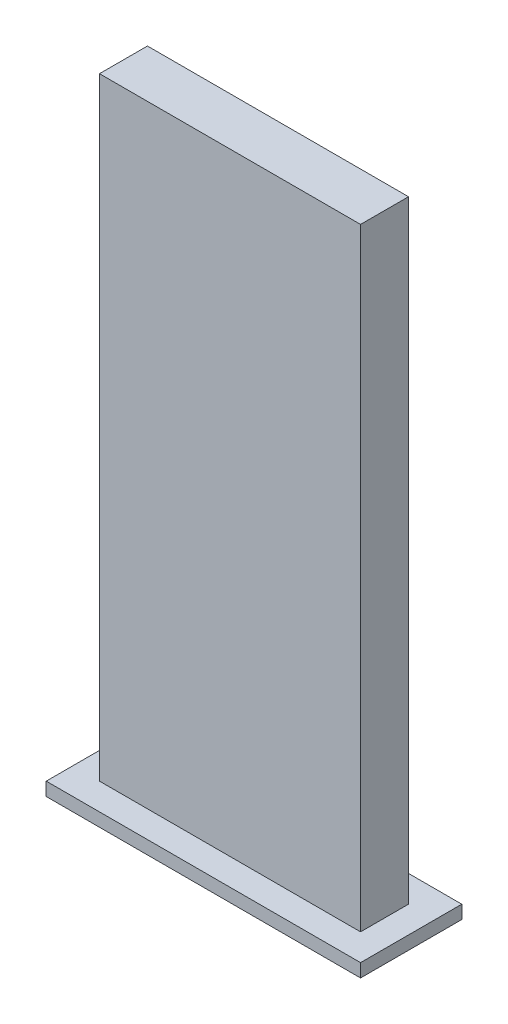
ISO-10303-21;
HEADER;
FILE_DESCRIPTION(('STEP AP214'),'2;1');
FILE_NAME('part.step','',(''),(''),'','','');
FILE_SCHEMA(('AUTOMOTIVE_DESIGN { 1 0 10303 214 1 1 1 1 }'));
ENDSEC;
DATA;
#1=APPLICATION_CONTEXT('core data for automotive mechanical design processes');
#2=APPLICATION_PROTOCOL_DEFINITION('international standard','automotive_design',2000,#1);
#3=PRODUCT_CONTEXT('',#1,'mechanical');
#4=PRODUCT('Part','Part','',(#3));
#5=PRODUCT_RELATED_PRODUCT_CATEGORY('part','',(#4));
#6=PRODUCT_DEFINITION_FORMATION('','',#4);
#7=PRODUCT_DEFINITION_CONTEXT('part definition',#1,'design');
#8=PRODUCT_DEFINITION('design','',#6,#7);
#9=PRODUCT_DEFINITION_SHAPE('','',#8);
#10=(LENGTH_UNIT() NAMED_UNIT(*) SI_UNIT(.MILLI.,.METRE.));
#11=(NAMED_UNIT(*) PLANE_ANGLE_UNIT() SI_UNIT($,.RADIAN.));
#12=(NAMED_UNIT(*) SI_UNIT($,.STERADIAN.) SOLID_ANGLE_UNIT());
#13=UNCERTAINTY_MEASURE_WITH_UNIT(LENGTH_MEASURE(1.E-05),#10,'distance_accuracy_value','');
#14=(GEOMETRIC_REPRESENTATION_CONTEXT(3) GLOBAL_UNCERTAINTY_ASSIGNED_CONTEXT((#13)) GLOBAL_UNIT_ASSIGNED_CONTEXT((#10,
#11,#12)) REPRESENTATION_CONTEXT('',''));
#15=CARTESIAN_POINT('',(0.,0.,0.));
#16=DIRECTION('',(0.,0.,1.));
#17=DIRECTION('',(1.,0.,0.));
#18=AXIS2_PLACEMENT_3D('',#15,#16,#17);
#19=CARTESIAN_POINT('',(0.,0.5,0.));
#20=DIRECTION('',(0.,1.,0.));
#21=DIRECTION('',(0.,0.,1.));
#22=AXIS2_PLACEMENT_3D('',#19,#20,#21);
#23=PLANE('',#22);
#24=DIRECTION('',(0.,0.,-1.));
#25=VECTOR('',#24,1.);
#26=CARTESIAN_POINT('',(5.9,0.5,-1.9));
#27=LINE('',#26,#25);
#28=CARTESIAN_POINT('',(5.9,0.5,1.9));
#29=VERTEX_POINT('',#28);
#30=CARTESIAN_POINT('',(5.9,0.5,-1.9));
#31=VERTEX_POINT('',#30);
#32=EDGE_CURVE('E140',#29,#31,#27,.T.);
#33=ORIENTED_EDGE('',*,*,#32,.T.);
#34=DIRECTION('',(-1.,0.,0.));
#35=VECTOR('',#34,1.);
#36=CARTESIAN_POINT('',(-5.9,0.5,-1.9));
#37=LINE('',#36,#35);
#38=CARTESIAN_POINT('',(-5.9,0.5,-1.9));
#39=VERTEX_POINT('',#38);
#40=EDGE_CURVE('E85',#31,#39,#37,.T.);
#41=ORIENTED_EDGE('',*,*,#40,.T.);
#42=DIRECTION('',(0.,0.,1.));
#43=VECTOR('',#42,1.);
#44=CARTESIAN_POINT('',(-5.9,0.5,-1.9));
#45=LINE('',#44,#43);
#46=CARTESIAN_POINT('',(-5.9,0.5,1.9));
#47=VERTEX_POINT('',#46);
#48=EDGE_CURVE('E143',#39,#47,#45,.T.);
#49=ORIENTED_EDGE('',*,*,#48,.T.);
#50=DIRECTION('',(1.,0.,0.));
#51=VECTOR('',#50,1.);
#52=CARTESIAN_POINT('',(-5.9,0.5,1.9));
#53=LINE('',#52,#51);
#54=EDGE_CURVE('E57',#47,#29,#53,.T.);
#55=ORIENTED_EDGE('',*,*,#54,.T.);
#56=EDGE_LOOP('',(#33,#41,#49,#55));
#57=FACE_BOUND('',#56,.T.);
#58=DIRECTION('',(-1.,0.,0.));
#59=VECTOR('',#58,1.);
#60=CARTESIAN_POINT('',(-4.9,0.5,-0.9));
#61=LINE('',#60,#59);
#62=CARTESIAN_POINT('',(4.9,0.5,-0.9));
#63=VERTEX_POINT('',#62);
#64=CARTESIAN_POINT('',(-4.9,0.5,-0.9));
#65=VERTEX_POINT('',#64);
#66=EDGE_CURVE('E263',#63,#65,#61,.T.);
#67=ORIENTED_EDGE('',*,*,#66,.F.);
#68=DIRECTION('',(0.,0.,-1.));
#69=VECTOR('',#68,1.);
#70=CARTESIAN_POINT('',(4.9,0.5,-0.9));
#71=LINE('',#70,#69);
#72=CARTESIAN_POINT('',(4.9,0.5,0.9));
#73=VERTEX_POINT('',#72);
#74=EDGE_CURVE('E130',#73,#63,#71,.T.);
#75=ORIENTED_EDGE('',*,*,#74,.F.);
#76=DIRECTION('',(1.,0.,0.));
#77=VECTOR('',#76,1.);
#78=CARTESIAN_POINT('',(-4.9,0.5,0.9));
#79=LINE('',#78,#77);
#80=CARTESIAN_POINT('',(-4.9,0.5,0.9));
#81=VERTEX_POINT('',#80);
#82=EDGE_CURVE('E126',#81,#73,#79,.T.);
#83=ORIENTED_EDGE('',*,*,#82,.F.);
#84=DIRECTION('',(0.,0.,1.));
#85=VECTOR('',#84,1.);
#86=CARTESIAN_POINT('',(-4.9,0.5,-0.9));
#87=LINE('',#86,#85);
#88=EDGE_CURVE('E260',#65,#81,#87,.T.);
#89=ORIENTED_EDGE('',*,*,#88,.F.);
#90=EDGE_LOOP('',(#67,#75,#83,#89));
#91=FACE_BOUND('',#90,.T.);
#92=ADVANCED_FACE('F33',(#57,#91),#23,.T.);
#93=CARTESIAN_POINT('',(5.9,0.5,-1.9));
#94=DIRECTION('',(-1.,0.,0.));
#95=DIRECTION('',(0.,0.,1.));
#96=AXIS2_PLACEMENT_3D('',#93,#94,#95);
#97=PLANE('',#96);
#98=DIRECTION('',(0.,0.,-1.));
#99=VECTOR('',#98,1.);
#100=CARTESIAN_POINT('',(5.9,0.,-1.9));
#101=LINE('',#100,#99);
#102=CARTESIAN_POINT('',(5.9,0.,1.9));
#103=VERTEX_POINT('',#102);
#104=CARTESIAN_POINT('',(5.9,0.,-1.9));
#105=VERTEX_POINT('',#104);
#106=EDGE_CURVE('E132',#103,#105,#101,.T.);
#107=ORIENTED_EDGE('',*,*,#106,.T.);
#108=DIRECTION('',(0.,-1.,0.));
#109=VECTOR('',#108,1.);
#110=CARTESIAN_POINT('',(5.9,0.5,-1.9));
#111=LINE('',#110,#109);
#112=EDGE_CURVE('E11',#31,#105,#111,.T.);
#113=ORIENTED_EDGE('',*,*,#112,.F.);
#114=ORIENTED_EDGE('',*,*,#32,.F.);
#115=DIRECTION('',(0.,-1.,0.));
#116=VECTOR('',#115,1.);
#117=CARTESIAN_POINT('',(5.9,0.5,1.9));
#118=LINE('',#117,#116);
#119=EDGE_CURVE('E145',#29,#103,#118,.T.);
#120=ORIENTED_EDGE('',*,*,#119,.T.);
#121=EDGE_LOOP('',(#107,#113,#114,#120));
#122=FACE_BOUND('',#121,.T.);
#123=ADVANCED_FACE('F35',(#122),#97,.F.);
#124=CARTESIAN_POINT('',(-5.9,0.5,-1.9));
#125=DIRECTION('',(0.,0.,1.));
#126=DIRECTION('',(1.,0.,0.));
#127=AXIS2_PLACEMENT_3D('',#124,#125,#126);
#128=PLANE('',#127);
#129=DIRECTION('',(-1.,0.,0.));
#130=VECTOR('',#129,1.);
#131=CARTESIAN_POINT('',(-5.9,0.,-1.9));
#132=LINE('',#131,#130);
#133=CARTESIAN_POINT('',(-5.9,0.,-1.9));
#134=VERTEX_POINT('',#133);
#135=EDGE_CURVE('E135',#105,#134,#132,.T.);
#136=ORIENTED_EDGE('',*,*,#135,.T.);
#137=DIRECTION('',(0.,-1.,0.));
#138=VECTOR('',#137,1.);
#139=CARTESIAN_POINT('',(-5.9,0.5,-1.9));
#140=LINE('',#139,#138);
#141=EDGE_CURVE('E41',#39,#134,#140,.T.);
#142=ORIENTED_EDGE('',*,*,#141,.F.);
#143=ORIENTED_EDGE('',*,*,#40,.F.);
#144=ORIENTED_EDGE('',*,*,#112,.T.);
#145=EDGE_LOOP('',(#136,#142,#143,#144));
#146=FACE_BOUND('',#145,.T.);
#147=ADVANCED_FACE('F173',(#146),#128,.F.);
#148=CARTESIAN_POINT('',(-5.9,0.5,-1.9));
#149=DIRECTION('',(1.,0.,0.));
#150=DIRECTION('',(0.,0.,-1.));
#151=AXIS2_PLACEMENT_3D('',#148,#149,#150);
#152=PLANE('',#151);
#153=DIRECTION('',(0.,0.,1.));
#154=VECTOR('',#153,1.);
#155=CARTESIAN_POINT('',(-5.9,0.,-1.9));
#156=LINE('',#155,#154);
#157=CARTESIAN_POINT('',(-5.9,0.,1.9));
#158=VERTEX_POINT('',#157);
#159=EDGE_CURVE('E148',#134,#158,#156,.T.);
#160=ORIENTED_EDGE('',*,*,#159,.T.);
#161=DIRECTION('',(0.,-1.,0.));
#162=VECTOR('',#161,1.);
#163=CARTESIAN_POINT('',(-5.9,0.5,1.9));
#164=LINE('',#163,#162);
#165=EDGE_CURVE('E152',#47,#158,#164,.T.);
#166=ORIENTED_EDGE('',*,*,#165,.F.);
#167=ORIENTED_EDGE('',*,*,#48,.F.);
#168=ORIENTED_EDGE('',*,*,#141,.T.);
#169=EDGE_LOOP('',(#160,#166,#167,#168));
#170=FACE_BOUND('',#169,.T.);
#171=ADVANCED_FACE('F157',(#170),#152,.F.);
#172=CARTESIAN_POINT('',(-5.9,0.5,1.9));
#173=DIRECTION('',(0.,0.,-1.));
#174=DIRECTION('',(-1.,0.,0.));
#175=AXIS2_PLACEMENT_3D('',#172,#173,#174);
#176=PLANE('',#175);
#177=DIRECTION('',(1.,0.,0.));
#178=VECTOR('',#177,1.);
#179=CARTESIAN_POINT('',(-5.9,0.,1.9));
#180=LINE('',#179,#178);
#181=EDGE_CURVE('E78',#158,#103,#180,.T.);
#182=ORIENTED_EDGE('',*,*,#181,.T.);
#183=ORIENTED_EDGE('',*,*,#119,.F.);
#184=ORIENTED_EDGE('',*,*,#54,.F.);
#185=ORIENTED_EDGE('',*,*,#165,.T.);
#186=EDGE_LOOP('',(#182,#183,#184,#185));
#187=FACE_BOUND('',#186,.T.);
#188=ADVANCED_FACE('F165',(#187),#176,.F.);
#189=CARTESIAN_POINT('',(0.,0.,0.));
#190=DIRECTION('',(0.,1.,0.));
#191=DIRECTION('',(0.,0.,1.));
#192=AXIS2_PLACEMENT_3D('',#189,#190,#191);
#193=PLANE('',#192);
#194=ORIENTED_EDGE('',*,*,#106,.F.);
#195=ORIENTED_EDGE('',*,*,#181,.F.);
#196=ORIENTED_EDGE('',*,*,#159,.F.);
#197=ORIENTED_EDGE('',*,*,#135,.F.);
#198=EDGE_LOOP('',(#194,#195,#196,#197));
#199=FACE_BOUND('',#198,.T.);
#200=ADVANCED_FACE('F161',(#199),#193,.F.);
#201=CARTESIAN_POINT('',(4.9,23.5,-0.9));
#202=DIRECTION('',(-1.,0.,0.));
#203=DIRECTION('',(0.,0.,1.));
#204=AXIS2_PLACEMENT_3D('',#201,#202,#203);
#205=PLANE('',#204);
#206=ORIENTED_EDGE('',*,*,#74,.T.);
#207=DIRECTION('',(0.,-1.,0.));
#208=VECTOR('',#207,1.);
#209=CARTESIAN_POINT('',(4.9,23.5,-0.9));
#210=LINE('',#209,#208);
#211=CARTESIAN_POINT('',(4.9,23.5,-0.9));
#212=VERTEX_POINT('',#211);
#213=EDGE_CURVE('E111',#212,#63,#210,.T.);
#214=ORIENTED_EDGE('',*,*,#213,.F.);
#215=DIRECTION('',(0.,0.,-1.));
#216=VECTOR('',#215,1.);
#217=CARTESIAN_POINT('',(4.9,23.5,-0.9));
#218=LINE('',#217,#216);
#219=CARTESIAN_POINT('',(4.9,23.5,0.9));
#220=VERTEX_POINT('',#219);
#221=EDGE_CURVE('E118',#220,#212,#218,.T.);
#222=ORIENTED_EDGE('',*,*,#221,.F.);
#223=DIRECTION('',(0.,-1.,0.));
#224=VECTOR('',#223,1.);
#225=CARTESIAN_POINT('',(4.9,23.5,0.9));
#226=LINE('',#225,#224);
#227=EDGE_CURVE('E258',#220,#73,#226,.T.);
#228=ORIENTED_EDGE('',*,*,#227,.T.);
#229=EDGE_LOOP('',(#206,#214,#222,#228));
#230=FACE_BOUND('',#229,.T.);
#231=ADVANCED_FACE('F128',(#230),#205,.F.);
#232=CARTESIAN_POINT('',(-4.9,23.5,-0.9));
#233=DIRECTION('',(0.,0.,1.));
#234=DIRECTION('',(1.,0.,0.));
#235=AXIS2_PLACEMENT_3D('',#232,#233,#234);
#236=PLANE('',#235);
#237=ORIENTED_EDGE('',*,*,#66,.T.);
#238=DIRECTION('',(0.,-1.,0.));
#239=VECTOR('',#238,1.);
#240=CARTESIAN_POINT('',(-4.9,23.5,-0.9));
#241=LINE('',#240,#239);
#242=CARTESIAN_POINT('',(-4.9,23.5,-0.9));
#243=VERTEX_POINT('',#242);
#244=EDGE_CURVE('E114',#243,#65,#241,.T.);
#245=ORIENTED_EDGE('',*,*,#244,.F.);
#246=DIRECTION('',(-1.,0.,0.));
#247=VECTOR('',#246,1.);
#248=CARTESIAN_POINT('',(-4.9,23.5,-0.9));
#249=LINE('',#248,#247);
#250=EDGE_CURVE('E107',#212,#243,#249,.T.);
#251=ORIENTED_EDGE('',*,*,#250,.F.);
#252=ORIENTED_EDGE('',*,*,#213,.T.);
#253=EDGE_LOOP('',(#237,#245,#251,#252));
#254=FACE_BOUND('',#253,.T.);
#255=ADVANCED_FACE('F109',(#254),#236,.F.);
#256=CARTESIAN_POINT('',(-4.9,23.5,-0.9));
#257=DIRECTION('',(1.,0.,0.));
#258=DIRECTION('',(0.,0.,-1.));
#259=AXIS2_PLACEMENT_3D('',#256,#257,#258);
#260=PLANE('',#259);
#261=ORIENTED_EDGE('',*,*,#88,.T.);
#262=DIRECTION('',(0.,-1.,0.));
#263=VECTOR('',#262,1.);
#264=CARTESIAN_POINT('',(-4.9,23.5,0.9));
#265=LINE('',#264,#263);
#266=CARTESIAN_POINT('',(-4.9,23.5,0.9));
#267=VERTEX_POINT('',#266);
#268=EDGE_CURVE('E48',#267,#81,#265,.T.);
#269=ORIENTED_EDGE('',*,*,#268,.F.);
#270=DIRECTION('',(0.,0.,1.));
#271=VECTOR('',#270,1.);
#272=CARTESIAN_POINT('',(-4.9,23.5,-0.9));
#273=LINE('',#272,#271);
#274=EDGE_CURVE('E117',#243,#267,#273,.T.);
#275=ORIENTED_EDGE('',*,*,#274,.F.);
#276=ORIENTED_EDGE('',*,*,#244,.T.);
#277=EDGE_LOOP('',(#261,#269,#275,#276));
#278=FACE_BOUND('',#277,.T.);
#279=ADVANCED_FACE('F186',(#278),#260,.F.);
#280=CARTESIAN_POINT('',(-4.9,23.5,0.9));
#281=DIRECTION('',(0.,0.,-1.));
#282=DIRECTION('',(-1.,0.,0.));
#283=AXIS2_PLACEMENT_3D('',#280,#281,#282);
#284=PLANE('',#283);
#285=ORIENTED_EDGE('',*,*,#82,.T.);
#286=ORIENTED_EDGE('',*,*,#227,.F.);
#287=DIRECTION('',(1.,0.,0.));
#288=VECTOR('',#287,1.);
#289=CARTESIAN_POINT('',(-4.9,23.5,0.9));
#290=LINE('',#289,#288);
#291=EDGE_CURVE('E122',#267,#220,#290,.T.);
#292=ORIENTED_EDGE('',*,*,#291,.F.);
#293=ORIENTED_EDGE('',*,*,#268,.T.);
#294=EDGE_LOOP('',(#285,#286,#292,#293));
#295=FACE_BOUND('',#294,.T.);
#296=ADVANCED_FACE('F189',(#295),#284,.F.);
#297=CARTESIAN_POINT('',(0.,23.5,0.));
#298=DIRECTION('',(0.,1.,0.));
#299=DIRECTION('',(0.,0.,1.));
#300=AXIS2_PLACEMENT_3D('',#297,#298,#299);
#301=PLANE('',#300);
#302=ORIENTED_EDGE('',*,*,#221,.T.);
#303=ORIENTED_EDGE('',*,*,#250,.T.);
#304=ORIENTED_EDGE('',*,*,#274,.T.);
#305=ORIENTED_EDGE('',*,*,#291,.T.);
#306=EDGE_LOOP('',(#302,#303,#304,#305));
#307=FACE_BOUND('',#306,.T.);
#308=ADVANCED_FACE('F121',(#307),#301,.T.);
#309=CLOSED_SHELL('',(#92,#123,#147,#171,#188,#200,#231,#255,#279,#296,#308));
#310=MANIFOLD_SOLID_BREP('B2',#309);
#311=ADVANCED_BREP_SHAPE_REPRESENTATION('',(#18,#310),#14);
#312=SHAPE_DEFINITION_REPRESENTATION(#9,#311);
ENDSEC;
END-ISO-10303-21;
